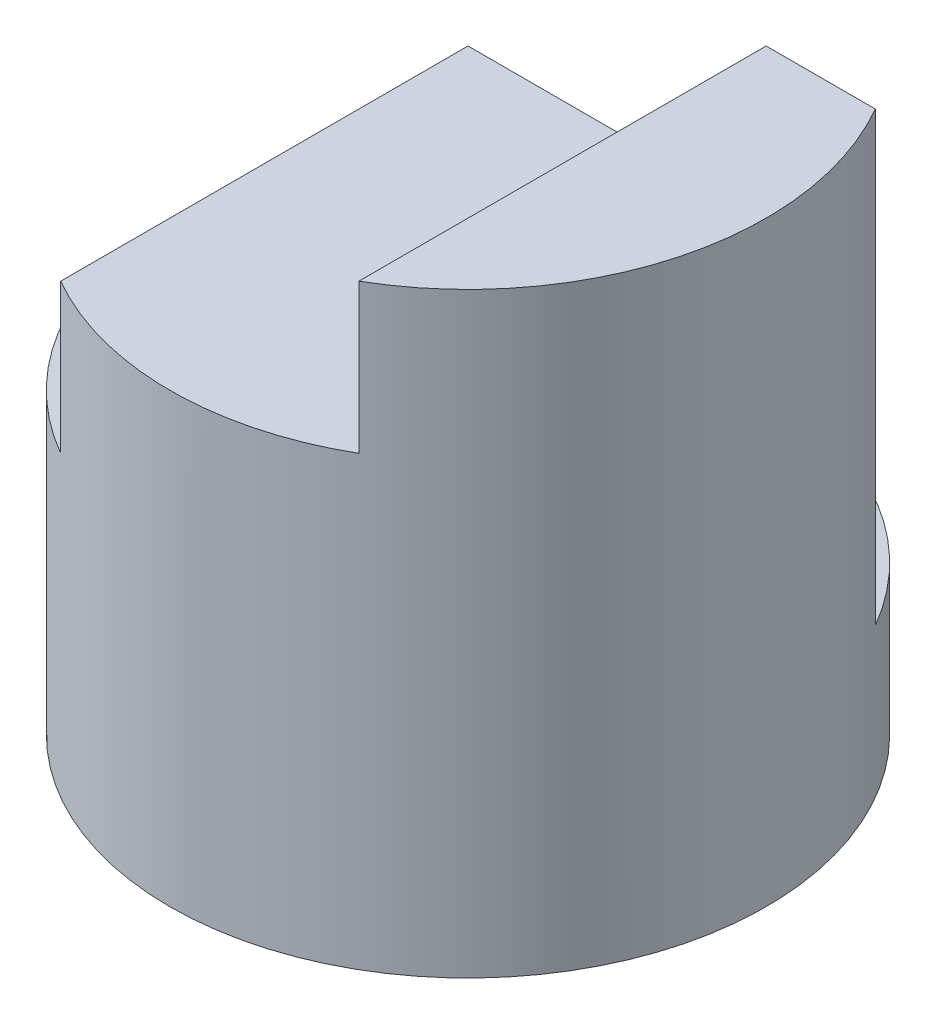
ISO-10303-21;
HEADER;
FILE_DESCRIPTION(('STEP AP214'),'2;1');
FILE_NAME('part.step','',(''),(''),'','','');
FILE_SCHEMA(('AUTOMOTIVE_DESIGN { 1 0 10303 214 1 1 1 1 }'));
ENDSEC;
DATA;
#1=APPLICATION_CONTEXT('core data for automotive mechanical design processes');
#2=APPLICATION_PROTOCOL_DEFINITION('international standard','automotive_design',2000,#1);
#3=PRODUCT_CONTEXT('',#1,'mechanical');
#4=PRODUCT('Part','Part','',(#3));
#5=PRODUCT_RELATED_PRODUCT_CATEGORY('part','',(#4));
#6=PRODUCT_DEFINITION_FORMATION('','',#4);
#7=PRODUCT_DEFINITION_CONTEXT('part definition',#1,'design');
#8=PRODUCT_DEFINITION('design','',#6,#7);
#9=PRODUCT_DEFINITION_SHAPE('','',#8);
#10=(LENGTH_UNIT() NAMED_UNIT(*) SI_UNIT(.MILLI.,.METRE.));
#11=(NAMED_UNIT(*) PLANE_ANGLE_UNIT() SI_UNIT($,.RADIAN.));
#12=(NAMED_UNIT(*) SI_UNIT($,.STERADIAN.) SOLID_ANGLE_UNIT());
#13=UNCERTAINTY_MEASURE_WITH_UNIT(LENGTH_MEASURE(1.E-05),#10,'distance_accuracy_value','');
#14=(GEOMETRIC_REPRESENTATION_CONTEXT(3) GLOBAL_UNCERTAINTY_ASSIGNED_CONTEXT((#13)) GLOBAL_UNIT_ASSIGNED_CONTEXT((#10,
#11,#12)) REPRESENTATION_CONTEXT('',''));
#15=CARTESIAN_POINT('',(0.,0.,0.));
#16=DIRECTION('',(0.,0.,1.));
#17=DIRECTION('',(1.,0.,0.));
#18=AXIS2_PLACEMENT_3D('',#15,#16,#17);
#19=CARTESIAN_POINT('',(0.,4.,0.));
#20=DIRECTION('',(0.,-1.,0.));
#21=DIRECTION('',(0.,0.,-1.));
#22=AXIS2_PLACEMENT_3D('',#19,#20,#21);
#23=CYLINDRICAL_SURFACE('',#22,2.);
#24=CARTESIAN_POINT('',(0.,2.,0.));
#25=DIRECTION('',(0.,-1.,0.));
#26=DIRECTION('',(0.,0.,-1.));
#27=AXIS2_PLACEMENT_3D('',#24,#25,#26);
#28=CIRCLE('',#27,2.);
#29=CARTESIAN_POINT('',(-1.,2.,1.73205080756888));
#30=VERTEX_POINT('',#29);
#31=CARTESIAN_POINT('',(-1.73205080756888,2.,-1.));
#32=VERTEX_POINT('',#31);
#33=EDGE_CURVE('E40',#30,#32,#28,.T.);
#34=ORIENTED_EDGE('',*,*,#33,.T.);
#35=DIRECTION('',(0.,1.,0.));
#36=VECTOR('',#35,1.);
#37=CARTESIAN_POINT('',(-1.73205080756888,1.,-1.));
#38=LINE('',#37,#36);
#39=CARTESIAN_POINT('',(-1.73205080756888,1.,-1.));
#40=VERTEX_POINT('',#39);
#41=EDGE_CURVE('E95',#40,#32,#38,.T.);
#42=ORIENTED_EDGE('',*,*,#41,.F.);
#43=CARTESIAN_POINT('',(0.,1.,0.));
#44=DIRECTION('',(0.,1.,0.));
#45=DIRECTION('',(0.,0.,-1.));
#46=AXIS2_PLACEMENT_3D('',#43,#44,#45);
#47=CIRCLE('',#46,2.);
#48=CARTESIAN_POINT('',(1.73205080756888,1.,-1.));
#49=VERTEX_POINT('',#48);
#50=EDGE_CURVE('E85',#49,#40,#47,.T.);
#51=ORIENTED_EDGE('',*,*,#50,.F.);
#52=DIRECTION('',(0.,1.,0.));
#53=VECTOR('',#52,1.);
#54=CARTESIAN_POINT('',(1.73205080756888,1.,-1.));
#55=LINE('',#54,#53);
#56=CARTESIAN_POINT('',(1.73205080756888,4.,-1.));
#57=VERTEX_POINT('',#56);
#58=EDGE_CURVE('E97',#49,#57,#55,.T.);
#59=ORIENTED_EDGE('',*,*,#58,.T.);
#60=CARTESIAN_POINT('',(0.,4.,0.));
#61=DIRECTION('',(0.,1.,0.));
#62=DIRECTION('',(0.,0.,1.));
#63=AXIS2_PLACEMENT_3D('',#60,#61,#62);
#64=CIRCLE('',#63,2.);
#65=CARTESIAN_POINT('',(1.,4.,1.73205080756888));
#66=VERTEX_POINT('',#65);
#67=EDGE_CURVE('E121',#66,#57,#64,.T.);
#68=ORIENTED_EDGE('',*,*,#67,.F.);
#69=DIRECTION('',(0.,-1.,0.));
#70=VECTOR('',#69,1.);
#71=CARTESIAN_POINT('',(1.,4.,1.73205080756888));
#72=LINE('',#71,#70);
#73=CARTESIAN_POINT('',(1.,3.,1.73205080756888));
#74=VERTEX_POINT('',#73);
#75=EDGE_CURVE('E54',#66,#74,#72,.T.);
#76=ORIENTED_EDGE('',*,*,#75,.T.);
#77=CARTESIAN_POINT('',(0.,3.,0.));
#78=DIRECTION('',(0.,-1.,0.));
#79=DIRECTION('',(1.,0.,0.));
#80=AXIS2_PLACEMENT_3D('',#77,#78,#79);
#81=CIRCLE('',#80,2.);
#82=CARTESIAN_POINT('',(-1.,3.,1.73205080756888));
#83=VERTEX_POINT('',#82);
#84=EDGE_CURVE('E128',#74,#83,#81,.T.);
#85=ORIENTED_EDGE('',*,*,#84,.T.);
#86=DIRECTION('',(0.,-1.,0.));
#87=VECTOR('',#86,1.);
#88=CARTESIAN_POINT('',(-1.,4.,1.73205080756888));
#89=LINE('',#88,#87);
#90=EDGE_CURVE('E131',#83,#30,#89,.T.);
#91=ORIENTED_EDGE('',*,*,#90,.T.);
#92=EDGE_LOOP('',(#34,#42,#51,#59,#68,#76,#85,#91));
#93=FACE_BOUND('',#92,.T.);
#94=CARTESIAN_POINT('',(0.,0.,0.));
#95=DIRECTION('',(0.,1.,0.));
#96=DIRECTION('',(0.,0.,1.));
#97=AXIS2_PLACEMENT_3D('',#94,#95,#96);
#98=CIRCLE('',#97,2.);
#99=CARTESIAN_POINT('',(0.,0.,2.));
#100=VERTEX_POINT('',#99);
#101=EDGE_CURVE('E120',#100,#100,#98,.T.);
#102=ORIENTED_EDGE('',*,*,#101,.T.);
#103=EDGE_LOOP('',(#102));
#104=FACE_BOUND('',#103,.T.);
#105=ADVANCED_FACE('F33',(#93,#104),#23,.T.);
#106=CARTESIAN_POINT('',(0.,4.,0.));
#107=DIRECTION('',(0.,1.,0.));
#108=DIRECTION('',(0.,0.,1.));
#109=AXIS2_PLACEMENT_3D('',#106,#107,#108);
#110=PLANE('',#109);
#111=DIRECTION('',(1.,0.,0.));
#112=VECTOR('',#111,1.);
#113=CARTESIAN_POINT('',(-1.73205080756888,4.,-1.));
#114=LINE('',#113,#112);
#115=CARTESIAN_POINT('',(0.999999999999999,4.,-1.));
#116=VERTEX_POINT('',#115);
#117=EDGE_CURVE('E92',#116,#57,#114,.T.);
#118=ORIENTED_EDGE('',*,*,#117,.F.);
#119=DIRECTION('',(0.,0.,-1.));
#120=VECTOR('',#119,1.);
#121=CARTESIAN_POINT('',(1.,4.,0.));
#122=LINE('',#121,#120);
#123=EDGE_CURVE('E124',#66,#116,#122,.T.);
#124=ORIENTED_EDGE('',*,*,#123,.F.);
#125=ORIENTED_EDGE('',*,*,#67,.T.);
#126=EDGE_LOOP('',(#118,#124,#125));
#127=FACE_BOUND('',#126,.T.);
#128=ADVANCED_FACE('F146',(#127),#110,.T.);
#129=CARTESIAN_POINT('',(0.,0.,0.));
#130=DIRECTION('',(0.,1.,0.));
#131=DIRECTION('',(0.,0.,1.));
#132=AXIS2_PLACEMENT_3D('',#129,#130,#131);
#133=PLANE('',#132);
#134=ORIENTED_EDGE('',*,*,#101,.F.);
#135=EDGE_LOOP('',(#134));
#136=FACE_BOUND('',#135,.T.);
#137=ADVANCED_FACE('F149',(#136),#133,.F.);
#138=CARTESIAN_POINT('',(1.,3.,-2.));
#139=DIRECTION('',(0.,-1.,0.));
#140=DIRECTION('',(1.,0.,0.));
#141=AXIS2_PLACEMENT_3D('',#138,#139,#140);
#142=PLANE('',#141);
#143=DIRECTION('',(0.,0.,1.));
#144=VECTOR('',#143,1.);
#145=CARTESIAN_POINT('',(1.,3.,-2.));
#146=LINE('',#145,#144);
#147=CARTESIAN_POINT('',(1.,3.,-1.));
#148=VERTEX_POINT('',#147);
#149=EDGE_CURVE('E114',#148,#74,#146,.T.);
#150=ORIENTED_EDGE('',*,*,#149,.F.);
#151=DIRECTION('',(-1.,0.,0.));
#152=VECTOR('',#151,1.);
#153=CARTESIAN_POINT('',(1.,3.,-1.));
#154=LINE('',#153,#152);
#155=CARTESIAN_POINT('',(-1.,3.,-1.));
#156=VERTEX_POINT('',#155);
#157=EDGE_CURVE('E47',#148,#156,#154,.T.);
#158=ORIENTED_EDGE('',*,*,#157,.T.);
#159=DIRECTION('',(0.,0.,1.));
#160=VECTOR('',#159,1.);
#161=CARTESIAN_POINT('',(-1.,3.,-2.));
#162=LINE('',#161,#160);
#163=EDGE_CURVE('E116',#156,#83,#162,.T.);
#164=ORIENTED_EDGE('',*,*,#163,.T.);
#165=ORIENTED_EDGE('',*,*,#84,.F.);
#166=EDGE_LOOP('',(#150,#158,#164,#165));
#167=FACE_BOUND('',#166,.T.);
#168=ADVANCED_FACE('F142',(#167),#142,.F.);
#169=CARTESIAN_POINT('',(-1.,3.,-2.));
#170=DIRECTION('',(1.,0.,0.));
#171=DIRECTION('',(0.,1.,0.));
#172=AXIS2_PLACEMENT_3D('',#169,#170,#171);
#173=PLANE('',#172);
#174=ORIENTED_EDGE('',*,*,#163,.F.);
#175=DIRECTION('',(0.,-1.,0.));
#176=VECTOR('',#175,1.);
#177=CARTESIAN_POINT('',(-1.,3.,-1.));
#178=LINE('',#177,#176);
#179=CARTESIAN_POINT('',(-1.,2.,-1.));
#180=VERTEX_POINT('',#179);
#181=EDGE_CURVE('E108',#156,#180,#178,.T.);
#182=ORIENTED_EDGE('',*,*,#181,.T.);
#183=DIRECTION('',(0.,0.,1.));
#184=VECTOR('',#183,1.);
#185=CARTESIAN_POINT('',(-1.,2.,-2.));
#186=LINE('',#185,#184);
#187=EDGE_CURVE('E113',#180,#30,#186,.T.);
#188=ORIENTED_EDGE('',*,*,#187,.T.);
#189=ORIENTED_EDGE('',*,*,#90,.F.);
#190=EDGE_LOOP('',(#174,#182,#188,#189));
#191=FACE_BOUND('',#190,.T.);
#192=ADVANCED_FACE('F136',(#191),#173,.F.);
#193=CARTESIAN_POINT('',(-1.,2.,-2.));
#194=DIRECTION('',(0.,-1.,0.));
#195=DIRECTION('',(0.,0.,-1.));
#196=AXIS2_PLACEMENT_3D('',#193,#194,#195);
#197=PLANE('',#196);
#198=ORIENTED_EDGE('',*,*,#187,.F.);
#199=DIRECTION('',(-1.,0.,0.));
#200=VECTOR('',#199,1.);
#201=CARTESIAN_POINT('',(-1.,2.,-1.));
#202=LINE('',#201,#200);
#203=EDGE_CURVE('E111',#180,#32,#202,.T.);
#204=ORIENTED_EDGE('',*,*,#203,.T.);
#205=ORIENTED_EDGE('',*,*,#33,.F.);
#206=EDGE_LOOP('',(#198,#204,#205));
#207=FACE_BOUND('',#206,.T.);
#208=ADVANCED_FACE('F139',(#207),#197,.F.);
#209=CARTESIAN_POINT('',(1.,4.,-2.));
#210=DIRECTION('',(1.,0.,0.));
#211=DIRECTION('',(0.,1.,0.));
#212=AXIS2_PLACEMENT_3D('',#209,#210,#211);
#213=PLANE('',#212);
#214=ORIENTED_EDGE('',*,*,#123,.T.);
#215=DIRECTION('',(0.,-1.,0.));
#216=VECTOR('',#215,1.);
#217=CARTESIAN_POINT('',(1.,4.,-1.));
#218=LINE('',#217,#216);
#219=EDGE_CURVE('E11',#116,#148,#218,.T.);
#220=ORIENTED_EDGE('',*,*,#219,.T.);
#221=ORIENTED_EDGE('',*,*,#149,.T.);
#222=ORIENTED_EDGE('',*,*,#75,.F.);
#223=EDGE_LOOP('',(#214,#220,#221,#222));
#224=FACE_BOUND('',#223,.T.);
#225=ADVANCED_FACE('F143',(#224),#213,.F.);
#226=CARTESIAN_POINT('',(-1.73205080756888,1.,-1.));
#227=DIRECTION('',(0.,0.,1.));
#228=DIRECTION('',(1.,0.,0.));
#229=AXIS2_PLACEMENT_3D('',#226,#227,#228);
#230=PLANE('',#229);
#231=ORIENTED_EDGE('',*,*,#181,.F.);
#232=ORIENTED_EDGE('',*,*,#157,.F.);
#233=ORIENTED_EDGE('',*,*,#219,.F.);
#234=ORIENTED_EDGE('',*,*,#117,.T.);
#235=ORIENTED_EDGE('',*,*,#58,.F.);
#236=DIRECTION('',(1.,0.,0.));
#237=VECTOR('',#236,1.);
#238=CARTESIAN_POINT('',(-1.73205080756888,1.,-1.));
#239=LINE('',#238,#237);
#240=EDGE_CURVE('E88',#40,#49,#239,.T.);
#241=ORIENTED_EDGE('',*,*,#240,.F.);
#242=ORIENTED_EDGE('',*,*,#41,.T.);
#243=ORIENTED_EDGE('',*,*,#203,.F.);
#244=EDGE_LOOP('',(#231,#232,#233,#234,#235,#241,#242,#243));
#245=FACE_BOUND('',#244,.T.);
#246=ADVANCED_FACE('F94',(#245),#230,.F.);
#247=CARTESIAN_POINT('',(0.,1.,0.));
#248=DIRECTION('',(0.,-1.,0.));
#249=DIRECTION('',(0.,0.,-1.));
#250=AXIS2_PLACEMENT_3D('',#247,#248,#249);
#251=PLANE('',#250);
#252=ORIENTED_EDGE('',*,*,#50,.T.);
#253=ORIENTED_EDGE('',*,*,#240,.T.);
#254=EDGE_LOOP('',(#252,#253));
#255=FACE_BOUND('',#254,.T.);
#256=ADVANCED_FACE('F87',(#255),#251,.F.);
#257=CLOSED_SHELL('',(#105,#128,#137,#168,#192,#208,#225,#246,#256));
#258=MANIFOLD_SOLID_BREP('B2',#257);
#259=ADVANCED_BREP_SHAPE_REPRESENTATION('',(#18,#258),#14);
#260=SHAPE_DEFINITION_REPRESENTATION(#9,#259);
ENDSEC;
END-ISO-10303-21;
